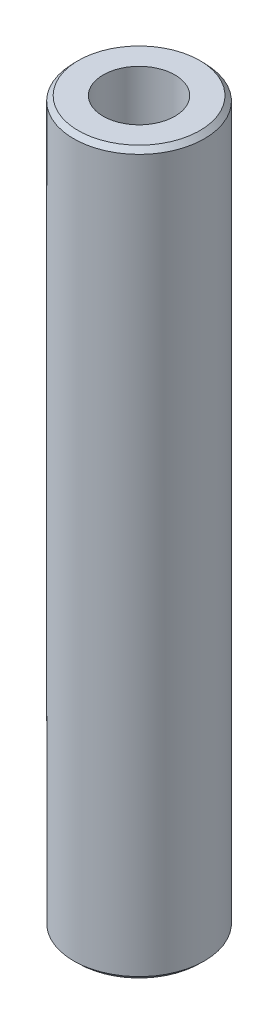
ISO-10303-21;
HEADER;
FILE_DESCRIPTION(('STEP AP214'),'2;1');
FILE_NAME('part.step','',(''),(''),'','','');
FILE_SCHEMA(('AUTOMOTIVE_DESIGN { 1 0 10303 214 1 1 1 1 }'));
ENDSEC;
DATA;
#1=APPLICATION_CONTEXT('core data for automotive mechanical design processes');
#2=APPLICATION_PROTOCOL_DEFINITION('international standard','automotive_design',2000,#1);
#3=PRODUCT_CONTEXT('',#1,'mechanical');
#4=PRODUCT('Part','Part','',(#3));
#5=PRODUCT_RELATED_PRODUCT_CATEGORY('part','',(#4));
#6=PRODUCT_DEFINITION_FORMATION('','',#4);
#7=PRODUCT_DEFINITION_CONTEXT('part definition',#1,'design');
#8=PRODUCT_DEFINITION('design','',#6,#7);
#9=PRODUCT_DEFINITION_SHAPE('','',#8);
#10=(LENGTH_UNIT() NAMED_UNIT(*) SI_UNIT(.MILLI.,.METRE.));
#11=(NAMED_UNIT(*) PLANE_ANGLE_UNIT() SI_UNIT($,.RADIAN.));
#12=(NAMED_UNIT(*) SI_UNIT($,.STERADIAN.) SOLID_ANGLE_UNIT());
#13=UNCERTAINTY_MEASURE_WITH_UNIT(LENGTH_MEASURE(1.E-05),#10,'distance_accuracy_value','');
#14=(GEOMETRIC_REPRESENTATION_CONTEXT(3) GLOBAL_UNCERTAINTY_ASSIGNED_CONTEXT((#13)) GLOBAL_UNIT_ASSIGNED_CONTEXT((#10,
#11,#12)) REPRESENTATION_CONTEXT('',''));
#15=CARTESIAN_POINT('',(0.,0.,0.));
#16=DIRECTION('',(0.,0.,1.));
#17=DIRECTION('',(1.,0.,0.));
#18=AXIS2_PLACEMENT_3D('',#15,#16,#17);
#19=CARTESIAN_POINT('',(0.,441.541938824037,0.));
#20=DIRECTION('',(0.,-1.,0.));
#21=DIRECTION('',(0.,0.,-1.));
#22=AXIS2_PLACEMENT_3D('',#19,#20,#21);
#23=CYLINDRICAL_SURFACE('',#22,40.);
#24=CARTESIAN_POINT('',(0.,438.636589719822,0.));
#25=DIRECTION('',(0.,1.,0.));
#26=DIRECTION('',(0.,0.,1.));
#27=AXIS2_PLACEMENT_3D('',#24,#25,#26);
#28=CIRCLE('',#27,40.);
#29=CARTESIAN_POINT('',(0.,438.636589719822,-40.));
#30=VERTEX_POINT('',#29);
#31=EDGE_CURVE('E50',#30,#30,#28,.F.);
#32=ORIENTED_EDGE('',*,*,#31,.T.);
#33=EDGE_LOOP('',(#32));
#34=FACE_BOUND('',#33,.T.);
#35=CARTESIAN_POINT('',(0.,2.80668191045452,0.));
#36=DIRECTION('',(0.,1.,0.));
#37=DIRECTION('',(0.,0.,1.));
#38=AXIS2_PLACEMENT_3D('',#35,#36,#37);
#39=CIRCLE('',#38,40.);
#40=CARTESIAN_POINT('',(0.,2.80668191045452,40.));
#41=VERTEX_POINT('',#40);
#42=EDGE_CURVE('E51',#41,#41,#39,.T.);
#43=ORIENTED_EDGE('',*,*,#42,.T.);
#44=EDGE_LOOP('',(#43));
#45=FACE_BOUND('',#44,.T.);
#46=ADVANCED_FACE('F39',(#34,#45),#23,.T.);
#47=CARTESIAN_POINT('',(0.,441.541938824037,0.));
#48=DIRECTION('',(0.,1.,0.));
#49=DIRECTION('',(0.,0.,1.));
#50=AXIS2_PLACEMENT_3D('',#47,#48,#49);
#51=PLANE('',#50);
#52=CARTESIAN_POINT('',(0.,441.541938824037,0.));
#53=DIRECTION('',(0.,1.,0.));
#54=DIRECTION('',(0.,0.,1.));
#55=AXIS2_PLACEMENT_3D('',#52,#53,#54);
#56=CIRCLE('',#55,37.1933180895455);
#57=CARTESIAN_POINT('',(0.,441.541938824037,-37.1933180895455));
#58=VERTEX_POINT('',#57);
#59=EDGE_CURVE('E54',#58,#58,#56,.T.);
#60=ORIENTED_EDGE('',*,*,#59,.T.);
#61=EDGE_LOOP('',(#60));
#62=FACE_BOUND('',#61,.T.);
#63=CARTESIAN_POINT('',(0.,441.541938824037,0.));
#64=DIRECTION('',(0.,1.,0.));
#65=DIRECTION('',(0.,0.,1.));
#66=AXIS2_PLACEMENT_3D('',#63,#64,#65);
#67=CIRCLE('',#66,21.9501133232838);
#68=CARTESIAN_POINT('',(0.,441.541938824037,21.9501133232838));
#69=VERTEX_POINT('',#68);
#70=EDGE_CURVE('E58',#69,#69,#67,.T.);
#71=ORIENTED_EDGE('',*,*,#70,.F.);
#72=EDGE_LOOP('',(#71));
#73=FACE_BOUND('',#72,.T.);
#74=ADVANCED_FACE('F69',(#62,#73),#51,.T.);
#75=CARTESIAN_POINT('',(0.,0.,0.));
#76=DIRECTION('',(0.,1.,0.));
#77=DIRECTION('',(0.,0.,1.));
#78=AXIS2_PLACEMENT_3D('',#75,#76,#77);
#79=PLANE('',#78);
#80=CARTESIAN_POINT('',(0.,0.,0.));
#81=DIRECTION('',(0.,1.,0.));
#82=DIRECTION('',(0.,0.,1.));
#83=AXIS2_PLACEMENT_3D('',#80,#81,#82);
#84=CIRCLE('',#83,37.0946508957846);
#85=CARTESIAN_POINT('',(0.,0.,37.0946508957846));
#86=VERTEX_POINT('',#85);
#87=EDGE_CURVE('E10',#86,#86,#84,.F.);
#88=ORIENTED_EDGE('',*,*,#87,.T.);
#89=EDGE_LOOP('',(#88));
#90=FACE_BOUND('',#89,.T.);
#91=CARTESIAN_POINT('',(0.,0.,0.));
#92=DIRECTION('',(0.,1.,0.));
#93=DIRECTION('',(0.,0.,1.));
#94=AXIS2_PLACEMENT_3D('',#91,#92,#93);
#95=CIRCLE('',#94,21.9501133232838);
#96=CARTESIAN_POINT('',(0.,0.,21.9501133232838));
#97=VERTEX_POINT('',#96);
#98=EDGE_CURVE('E63',#97,#97,#95,.T.);
#99=ORIENTED_EDGE('',*,*,#98,.T.);
#100=EDGE_LOOP('',(#99));
#101=FACE_BOUND('',#100,.T.);
#102=ADVANCED_FACE('F75',(#90,#101),#79,.F.);
#103=CARTESIAN_POINT('',(0.,441.541938824037,0.));
#104=DIRECTION('',(0.,-1.,0.));
#105=DIRECTION('',(0.,0.,-1.));
#106=AXIS2_PLACEMENT_3D('',#103,#104,#105);
#107=CYLINDRICAL_SURFACE('',#106,21.9501133232838);
#108=ORIENTED_EDGE('',*,*,#70,.T.);
#109=EDGE_LOOP('',(#108));
#110=FACE_BOUND('',#109,.T.);
#111=ORIENTED_EDGE('',*,*,#98,.F.);
#112=EDGE_LOOP('',(#111));
#113=FACE_BOUND('',#112,.T.);
#114=ADVANCED_FACE('F70',(#110,#113),#107,.F.);
#115=CARTESIAN_POINT('',(0.,441.541938824037,0.));
#116=DIRECTION('',(0.,-1.,0.));
#117=DIRECTION('',(0.,0.,-1.));
#118=AXIS2_PLACEMENT_3D('',#115,#116,#117);
#119=CONICAL_SURFACE('',#118,37.1933180895455,0.768126306514316);
#120=CARTESIAN_POINT('',(0.,438.636589719822,-40.));
#121=CARTESIAN_POINT('',(0.,438.666853772991,-39.9707637300995));
#122=CARTESIAN_POINT('',(0.,438.697117826159,-39.9415274601989));
#123=CARTESIAN_POINT('',(0.,438.757645932497,-39.8830549203978));
#124=CARTESIAN_POINT('',(0.,438.787909985666,-39.8538186504972));
#125=CARTESIAN_POINT('',(0.,438.848438092004,-39.7953461106961));
#126=CARTESIAN_POINT('',(0.,438.878702145173,-39.7661098407955));
#127=CARTESIAN_POINT('',(0.,438.939230251511,-39.7076373009944));
#128=CARTESIAN_POINT('',(0.,438.96949430468,-39.6784010310938));
#129=CARTESIAN_POINT('',(0.,439.030022411017,-39.6199284912926));
#130=CARTESIAN_POINT('',(0.,439.060286464186,-39.5906922213921));
#131=CARTESIAN_POINT('',(0.,439.120814570524,-39.5322196815909));
#132=CARTESIAN_POINT('',(0.,439.151078623693,-39.5029834116904));
#133=CARTESIAN_POINT('',(0.,439.211606730031,-39.4445108718892));
#134=CARTESIAN_POINT('',(0.,439.2418707832,-39.4152746019887));
#135=CARTESIAN_POINT('',(0.,439.302398889538,-39.3568020621875));
#136=CARTESIAN_POINT('',(0.,439.332662942707,-39.327565792287));
#137=CARTESIAN_POINT('',(0.,439.393191049044,-39.2690932524858));
#138=CARTESIAN_POINT('',(0.,439.423455102213,-39.2398569825853));
#139=CARTESIAN_POINT('',(0.,439.483983208551,-39.1813844427841));
#140=CARTESIAN_POINT('',(0.,439.51424726172,-39.1521481728836));
#141=CARTESIAN_POINT('',(0.,439.574775368058,-39.0936756330824));
#142=CARTESIAN_POINT('',(0.,439.605039421227,-39.0644393631819));
#143=CARTESIAN_POINT('',(0.,439.665567527565,-39.0059668233807));
#144=CARTESIAN_POINT('',(0.,439.695831580734,-38.9767305534802));
#145=CARTESIAN_POINT('',(0.,439.756359687071,-38.918258013679));
#146=CARTESIAN_POINT('',(0.,439.78662374024,-38.8890217437785));
#147=CARTESIAN_POINT('',(0.,439.847151846578,-38.8305492039773));
#148=CARTESIAN_POINT('',(0.,439.877415899747,-38.8013129340768));
#149=CARTESIAN_POINT('',(0.,439.937944006085,-38.7428403942756));
#150=CARTESIAN_POINT('',(0.,439.968208059254,-38.7136041243751));
#151=CARTESIAN_POINT('',(0.,440.028736165592,-38.6551315845739));
#152=CARTESIAN_POINT('',(0.,440.05900021876,-38.6258953146733));
#153=CARTESIAN_POINT('',(0.,440.119528325098,-38.5674227748722));
#154=CARTESIAN_POINT('',(0.,440.149792378267,-38.5381865049717));
#155=CARTESIAN_POINT('',(0.,440.210320484605,-38.4797139651705));
#156=CARTESIAN_POINT('',(0.,440.240584537774,-38.4504776952699));
#157=CARTESIAN_POINT('',(0.,440.301112644112,-38.3920051554688));
#158=CARTESIAN_POINT('',(0.,440.331376697281,-38.3627688855682));
#159=CARTESIAN_POINT('',(0.,440.391904803618,-38.3042963457671));
#160=CARTESIAN_POINT('',(0.,440.422168856787,-38.2750600758665));
#161=CARTESIAN_POINT('',(0.,440.482696963125,-38.2165875360654));
#162=CARTESIAN_POINT('',(0.,440.512961016294,-38.1873512661648));
#163=CARTESIAN_POINT('',(0.,440.573489122632,-38.1288787263637));
#164=CARTESIAN_POINT('',(0.,440.603753175801,-38.0996424564631));
#165=CARTESIAN_POINT('',(0.,440.664281282139,-38.041169916662));
#166=CARTESIAN_POINT('',(0.,440.694545335308,-38.0119336467614));
#167=CARTESIAN_POINT('',(0.,440.755073441645,-37.9534611069603));
#168=CARTESIAN_POINT('',(0.,440.785337494814,-37.9242248370597));
#169=CARTESIAN_POINT('',(0.,440.845865601152,-37.8657522972586));
#170=CARTESIAN_POINT('',(0.,440.876129654321,-37.836516027358));
#171=CARTESIAN_POINT('',(0.,440.936657760659,-37.7780434875569));
#172=CARTESIAN_POINT('',(0.,440.966921813828,-37.7488072176563));
#173=CARTESIAN_POINT('',(0.,441.027449920166,-37.6903346778552));
#174=CARTESIAN_POINT('',(0.,441.057713973335,-37.6610984079546));
#175=CARTESIAN_POINT('',(0.,441.118242079672,-37.6026258681535));
#176=CARTESIAN_POINT('',(0.,441.148506132841,-37.5733895982529));
#177=CARTESIAN_POINT('',(0.,441.209034239179,-37.5149170584518));
#178=CARTESIAN_POINT('',(0.,441.239298292348,-37.4856807885512));
#179=CARTESIAN_POINT('',(0.,441.299826398686,-37.4272082487501));
#180=CARTESIAN_POINT('',(0.,441.330090451855,-37.3979719788495));
#181=CARTESIAN_POINT('',(0.,441.390618558193,-37.3394994390484));
#182=CARTESIAN_POINT('',(0.,441.420882611361,-37.3102631691478));
#183=CARTESIAN_POINT('',(0.,441.481410717699,-37.2517906293467));
#184=CARTESIAN_POINT('',(0.,441.511674770868,-37.2225543594461));
#185=CARTESIAN_POINT('',(0.,441.541938824037,-37.1933180895455));
#186=B_SPLINE_CURVE_WITH_KNOTS('',3,(#120,#121,#122,#123,#124,#125,#126,#127,#128,#129,#130,
#131,#132,#133,#134,#135,#136,#137,#138,#139,#140,#141,#142,#143,#144,#145,#146,#147,#148,#149,
#150,#151,#152,#153,#154,#155,#156,#157,#158,#159,#160,#161,#162,#163,#164,#165,#166,#167,#168,
#169,#170,#171,#172,#173,#174,#175,#176,#177,#178,#179,#180,#181,#182,#183,#184,#185),
.UNSPECIFIED.,.F.,.F.,(4,2,2,2,2,2,2,2,2,2,2,2,2,2,2,2,2,2,2,2,2,2,2,2,2,2,2,2,2,2,2,2,4),(0.,
0.126238074791989,0.252476149583982,0.378714224375971,0.50495229916792,0.631190373959914,
0.757428448751902,0.883666523543891,1.00990459833584,1.13614267312783,1.26238074791982,
1.38861882271178,1.51485689750376,1.64109497229576,1.76733304708775,1.8935711218797,
2.01980919667169,2.14604727146368,2.27228534625563,2.39852342104762,2.52476149583961,
2.6509995706316,2.77723764542355,2.90347572021554,3.02971379500753,3.15595186979948,
3.28218994459147,3.40842801938346,3.53466609417546,3.6609041689674,3.78714224375939,
3.91338031855139,4.03961839334337),.UNSPECIFIED.);
#187=EDGE_CURVE('BSEAM81',#30,#58,#186,.T.);
#188=ORIENTED_EDGE('',*,*,#31,.F.);
#189=ORIENTED_EDGE('',*,*,#59,.F.);
#190=ORIENTED_EDGE('',*,*,#187,.T.);
#191=ORIENTED_EDGE('',*,*,#187,.F.);
#192=EDGE_LOOP('',(#188,#190,#189,#191));
#193=FACE_BOUND('',#192,.T.);
#194=ADVANCED_FACE('F81',(#193),#119,.T.);
#195=CARTESIAN_POINT('',(0.,2.80668191045452,0.));
#196=DIRECTION('',(0.,1.,0.));
#197=DIRECTION('',(0.,0.,1.));
#198=AXIS2_PLACEMENT_3D('',#195,#196,#197);
#199=CONICAL_SURFACE('',#198,40.,0.802670020280578);
#200=ORIENTED_EDGE('',*,*,#87,.F.);
#201=EDGE_LOOP('',(#200));
#202=FACE_BOUND('',#201,.T.);
#203=ORIENTED_EDGE('',*,*,#42,.F.);
#204=EDGE_LOOP('',(#203));
#205=FACE_BOUND('',#204,.T.);
#206=ADVANCED_FACE('F45',(#202,#205),#199,.T.);
#207=CLOSED_SHELL('',(#46,#74,#102,#114,#194,#206));
#208=MANIFOLD_SOLID_BREP('B2',#207);
#209=ADVANCED_BREP_SHAPE_REPRESENTATION('',(#18,#208),#14);
#210=SHAPE_DEFINITION_REPRESENTATION(#9,#209);
ENDSEC;
END-ISO-10303-21;
